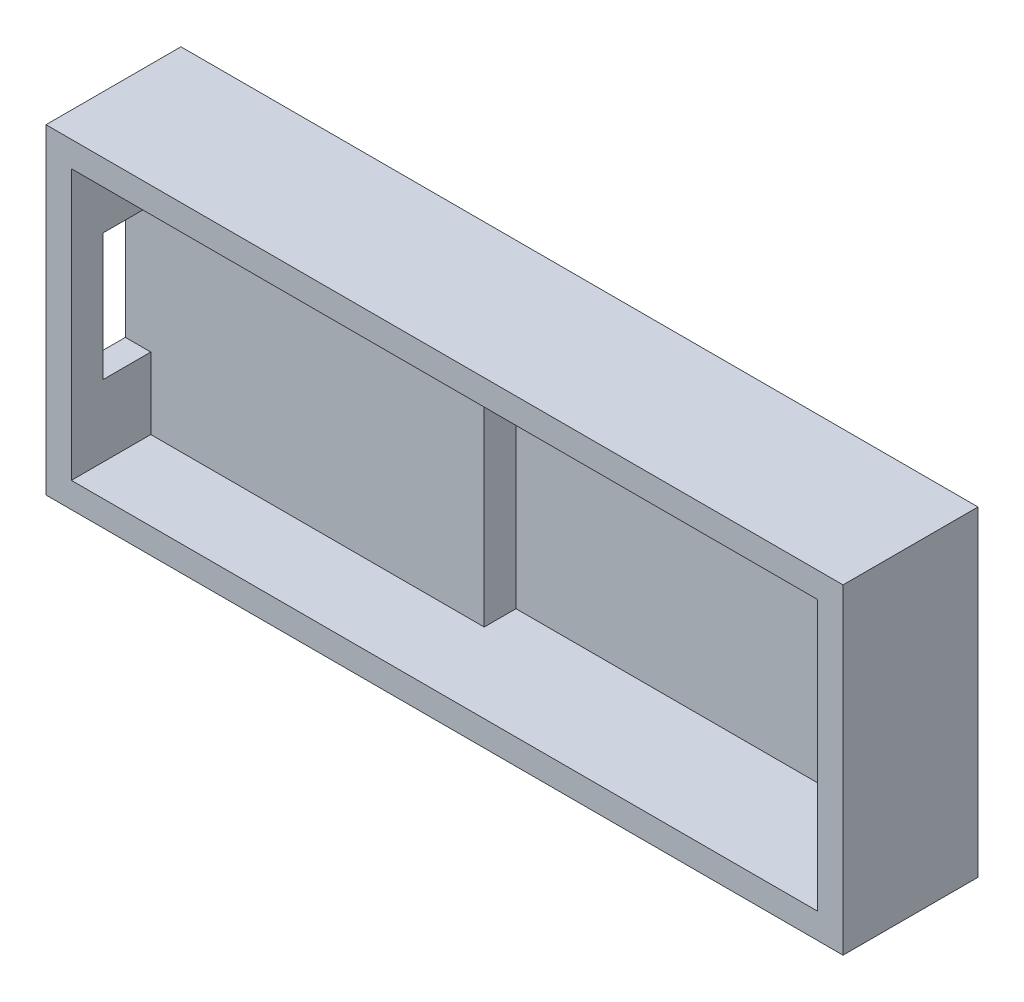
ISO-10303-21;
HEADER;
FILE_DESCRIPTION(('STEP AP214'),'2;1');
FILE_NAME('part.step','',(''),(''),'','','');
FILE_SCHEMA(('AUTOMOTIVE_DESIGN { 1 0 10303 214 1 1 1 1 }'));
ENDSEC;
DATA;
#1=APPLICATION_CONTEXT('core data for automotive mechanical design processes');
#2=APPLICATION_PROTOCOL_DEFINITION('international standard','automotive_design',2000,#1);
#3=PRODUCT_CONTEXT('',#1,'mechanical');
#4=PRODUCT('Part','Part','',(#3));
#5=PRODUCT_RELATED_PRODUCT_CATEGORY('part','',(#4));
#6=PRODUCT_DEFINITION_FORMATION('','',#4);
#7=PRODUCT_DEFINITION_CONTEXT('part definition',#1,'design');
#8=PRODUCT_DEFINITION('design','',#6,#7);
#9=PRODUCT_DEFINITION_SHAPE('','',#8);
#10=(LENGTH_UNIT() NAMED_UNIT(*) SI_UNIT(.MILLI.,.METRE.));
#11=(NAMED_UNIT(*) PLANE_ANGLE_UNIT() SI_UNIT($,.RADIAN.));
#12=(NAMED_UNIT(*) SI_UNIT($,.STERADIAN.) SOLID_ANGLE_UNIT());
#13=UNCERTAINTY_MEASURE_WITH_UNIT(LENGTH_MEASURE(1.E-05),#10,'distance_accuracy_value','');
#14=(GEOMETRIC_REPRESENTATION_CONTEXT(3) GLOBAL_UNCERTAINTY_ASSIGNED_CONTEXT((#13)) GLOBAL_UNIT_ASSIGNED_CONTEXT((#10,
#11,#12)) REPRESENTATION_CONTEXT('',''));
#15=CARTESIAN_POINT('',(0.,0.,0.));
#16=DIRECTION('',(0.,0.,1.));
#17=DIRECTION('',(1.,0.,0.));
#18=AXIS2_PLACEMENT_3D('',#15,#16,#17);
#19=CARTESIAN_POINT('',(0.,0.,1.5));
#20=DIRECTION('',(0.,0.,1.));
#21=DIRECTION('',(1.,0.,0.));
#22=AXIS2_PLACEMENT_3D('',#19,#20,#21);
#23=PLANE('',#22);
#24=DIRECTION('',(0.,-1.,0.));
#25=VECTOR('',#24,1.);
#26=CARTESIAN_POINT('',(19.5,-8.5,1.5));
#27=LINE('',#26,#25);
#28=CARTESIAN_POINT('',(19.5,-6.5,1.5));
#29=VERTEX_POINT('',#28);
#30=CARTESIAN_POINT('',(19.5,-8.5,1.5));
#31=VERTEX_POINT('',#30);
#32=EDGE_CURVE('E266',#29,#31,#27,.T.);
#33=ORIENTED_EDGE('',*,*,#32,.F.);
#34=DIRECTION('',(-1.,0.,0.));
#35=VECTOR('',#34,1.);
#36=CARTESIAN_POINT('',(23.5,-6.5,1.5));
#37=LINE('',#36,#35);
#38=CARTESIAN_POINT('',(23.5,-6.5,1.5));
#39=VERTEX_POINT('',#38);
#40=EDGE_CURVE('E261',#39,#29,#37,.T.);
#41=ORIENTED_EDGE('',*,*,#40,.F.);
#42=DIRECTION('',(0.,1.,0.));
#43=VECTOR('',#42,1.);
#44=CARTESIAN_POINT('',(23.5,8.5,1.5));
#45=LINE('',#44,#43);
#46=CARTESIAN_POINT('',(23.5,6.5,1.5));
#47=VERTEX_POINT('',#46);
#48=EDGE_CURVE('E44',#39,#47,#45,.T.);
#49=ORIENTED_EDGE('',*,*,#48,.T.);
#50=DIRECTION('',(1.,0.,0.));
#51=VECTOR('',#50,1.);
#52=CARTESIAN_POINT('',(23.5,6.5,1.5));
#53=LINE('',#52,#51);
#54=CARTESIAN_POINT('',(19.5,6.5,1.5));
#55=VERTEX_POINT('',#54);
#56=EDGE_CURVE('E291',#55,#47,#53,.T.);
#57=ORIENTED_EDGE('',*,*,#56,.F.);
#58=DIRECTION('',(0.,-1.,0.));
#59=VECTOR('',#58,1.);
#60=CARTESIAN_POINT('',(19.5,8.5,1.5));
#61=LINE('',#60,#59);
#62=CARTESIAN_POINT('',(19.5,8.5,1.5));
#63=VERTEX_POINT('',#62);
#64=EDGE_CURVE('E286',#63,#55,#61,.T.);
#65=ORIENTED_EDGE('',*,*,#64,.F.);
#66=DIRECTION('',(-1.,0.,0.));
#67=VECTOR('',#66,1.);
#68=CARTESIAN_POINT('',(-23.5,8.5,1.5));
#69=LINE('',#68,#67);
#70=CARTESIAN_POINT('',(-2.5,8.5,1.5));
#71=VERTEX_POINT('',#70);
#72=EDGE_CURVE('E12',#63,#71,#69,.T.);
#73=ORIENTED_EDGE('',*,*,#72,.T.);
#74=DIRECTION('',(0.,1.,0.));
#75=VECTOR('',#74,1.);
#76=CARTESIAN_POINT('',(-2.5,8.5,1.5));
#77=LINE('',#76,#75);
#78=CARTESIAN_POINT('',(-2.5,-8.5,1.5));
#79=VERTEX_POINT('',#78);
#80=EDGE_CURVE('E310',#79,#71,#77,.T.);
#81=ORIENTED_EDGE('',*,*,#80,.F.);
#82=DIRECTION('',(1.,0.,0.));
#83=VECTOR('',#82,1.);
#84=CARTESIAN_POINT('',(-23.5,-8.5,1.5));
#85=LINE('',#84,#83);
#86=EDGE_CURVE('E333',#79,#31,#85,.T.);
#87=ORIENTED_EDGE('',*,*,#86,.T.);
#88=EDGE_LOOP('',(#33,#41,#49,#57,#65,#73,#81,#87));
#89=FACE_BOUND('',#88,.T.);
#90=ADVANCED_FACE('F35',(#89),#23,.T.);
#91=CARTESIAN_POINT('',(-2.5,8.5,3.5));
#92=DIRECTION('',(-1.,0.,0.));
#93=DIRECTION('',(0.,-1.,0.));
#94=AXIS2_PLACEMENT_3D('',#91,#92,#93);
#95=PLANE('',#94);
#96=ORIENTED_EDGE('',*,*,#80,.T.);
#97=DIRECTION('',(0.,0.,-1.));
#98=VECTOR('',#97,1.);
#99=CARTESIAN_POINT('',(-2.5,8.5,3.5));
#100=LINE('',#99,#98);
#101=CARTESIAN_POINT('',(-2.5,8.5,3.5));
#102=VERTEX_POINT('',#101);
#103=EDGE_CURVE('E324',#102,#71,#100,.T.);
#104=ORIENTED_EDGE('',*,*,#103,.F.);
#105=DIRECTION('',(0.,1.,0.));
#106=VECTOR('',#105,1.);
#107=CARTESIAN_POINT('',(-2.5,8.5,3.5));
#108=LINE('',#107,#106);
#109=CARTESIAN_POINT('',(-2.5,-8.5,3.5));
#110=VERTEX_POINT('',#109);
#111=EDGE_CURVE('E318',#110,#102,#108,.T.);
#112=ORIENTED_EDGE('',*,*,#111,.F.);
#113=DIRECTION('',(0.,0.,-1.));
#114=VECTOR('',#113,1.);
#115=CARTESIAN_POINT('',(-2.5,-8.5,3.5));
#116=LINE('',#115,#114);
#117=EDGE_CURVE('E335',#110,#79,#116,.T.);
#118=ORIENTED_EDGE('',*,*,#117,.T.);
#119=EDGE_LOOP('',(#96,#104,#112,#118));
#120=FACE_BOUND('',#119,.T.);
#121=ADVANCED_FACE('F361',(#120),#95,.F.);
#122=CARTESIAN_POINT('',(0.,0.,3.5));
#123=DIRECTION('',(0.,0.,1.));
#124=DIRECTION('',(1.,0.,0.));
#125=AXIS2_PLACEMENT_3D('',#122,#123,#124);
#126=PLANE('',#125);
#127=DIRECTION('',(0.,-1.,0.));
#128=VECTOR('',#127,1.);
#129=CARTESIAN_POINT('',(-23.5,8.5,3.5));
#130=LINE('',#129,#128);
#131=CARTESIAN_POINT('',(-23.5,8.5,3.5));
#132=VERTEX_POINT('',#131);
#133=CARTESIAN_POINT('',(-23.5,4.,3.5));
#134=VERTEX_POINT('',#133);
#135=EDGE_CURVE('E311',#132,#134,#130,.T.);
#136=ORIENTED_EDGE('',*,*,#135,.T.);
#137=DIRECTION('',(1.,0.,0.));
#138=VECTOR('',#137,1.);
#139=CARTESIAN_POINT('',(-25.1,4.,3.5));
#140=LINE('',#139,#138);
#141=CARTESIAN_POINT('',(-25.1,4.,3.5));
#142=VERTEX_POINT('',#141);
#143=EDGE_CURVE('E201',#142,#134,#140,.T.);
#144=ORIENTED_EDGE('',*,*,#143,.F.);
#145=DIRECTION('',(0.,1.,0.));
#146=VECTOR('',#145,1.);
#147=CARTESIAN_POINT('',(-25.1,4.,3.5));
#148=LINE('',#147,#146);
#149=CARTESIAN_POINT('',(-25.1,-4.,3.5));
#150=VERTEX_POINT('',#149);
#151=EDGE_CURVE('E181',#150,#142,#148,.T.);
#152=ORIENTED_EDGE('',*,*,#151,.F.);
#153=DIRECTION('',(1.,0.,0.));
#154=VECTOR('',#153,1.);
#155=CARTESIAN_POINT('',(-25.1,-4.,3.5));
#156=LINE('',#155,#154);
#157=CARTESIAN_POINT('',(-23.5,-4.,3.5));
#158=VERTEX_POINT('',#157);
#159=EDGE_CURVE('E204',#150,#158,#156,.T.);
#160=ORIENTED_EDGE('',*,*,#159,.T.);
#161=CARTESIAN_POINT('',(-23.5,-8.5,3.5));
#162=VERTEX_POINT('',#161);
#163=EDGE_CURVE('E315',#158,#162,#130,.T.);
#164=ORIENTED_EDGE('',*,*,#163,.T.);
#165=DIRECTION('',(1.,0.,0.));
#166=VECTOR('',#165,1.);
#167=CARTESIAN_POINT('',(-23.5,-8.5,3.5));
#168=LINE('',#167,#166);
#169=EDGE_CURVE('E314',#162,#110,#168,.T.);
#170=ORIENTED_EDGE('',*,*,#169,.T.);
#171=ORIENTED_EDGE('',*,*,#111,.T.);
#172=DIRECTION('',(-1.,0.,0.));
#173=VECTOR('',#172,1.);
#174=CARTESIAN_POINT('',(-23.5,8.5,3.5));
#175=LINE('',#174,#173);
#176=EDGE_CURVE('E321',#102,#132,#175,.T.);
#177=ORIENTED_EDGE('',*,*,#176,.T.);
#178=EDGE_LOOP('',(#136,#144,#152,#160,#164,#170,#171,#177));
#179=FACE_BOUND('',#178,.T.);
#180=ADVANCED_FACE('F365',(#179),#126,.T.);
#181=CARTESIAN_POINT('',(19.5,8.5,3.5));
#182=DIRECTION('',(1.,0.,0.));
#183=DIRECTION('',(0.,0.,-1.));
#184=AXIS2_PLACEMENT_3D('',#181,#182,#183);
#185=PLANE('',#184);
#186=ORIENTED_EDGE('',*,*,#64,.T.);
#187=DIRECTION('',(0.,0.,-1.));
#188=VECTOR('',#187,1.);
#189=CARTESIAN_POINT('',(19.5,6.5,3.5));
#190=LINE('',#189,#188);
#191=CARTESIAN_POINT('',(19.5,6.5,3.5));
#192=VERTEX_POINT('',#191);
#193=EDGE_CURVE('E305',#192,#55,#190,.T.);
#194=ORIENTED_EDGE('',*,*,#193,.F.);
#195=DIRECTION('',(0.,-1.,0.));
#196=VECTOR('',#195,1.);
#197=CARTESIAN_POINT('',(19.5,8.5,3.5));
#198=LINE('',#197,#196);
#199=CARTESIAN_POINT('',(19.5,8.5,3.5));
#200=VERTEX_POINT('',#199);
#201=EDGE_CURVE('E294',#200,#192,#198,.T.);
#202=ORIENTED_EDGE('',*,*,#201,.F.);
#203=DIRECTION('',(0.,0.,-1.));
#204=VECTOR('',#203,1.);
#205=CARTESIAN_POINT('',(19.5,8.5,3.5));
#206=LINE('',#205,#204);
#207=EDGE_CURVE('E307',#200,#63,#206,.T.);
#208=ORIENTED_EDGE('',*,*,#207,.T.);
#209=EDGE_LOOP('',(#186,#194,#202,#208));
#210=FACE_BOUND('',#209,.T.);
#211=ADVANCED_FACE('F358',(#210),#185,.F.);
#212=CARTESIAN_POINT('',(23.5,6.5,3.5));
#213=DIRECTION('',(0.,1.,0.));
#214=DIRECTION('',(-1.,0.,0.));
#215=AXIS2_PLACEMENT_3D('',#212,#213,#214);
#216=PLANE('',#215);
#217=ORIENTED_EDGE('',*,*,#56,.T.);
#218=DIRECTION('',(0.,0.,-1.));
#219=VECTOR('',#218,1.);
#220=CARTESIAN_POINT('',(23.5,6.5,3.5));
#221=LINE('',#220,#219);
#222=CARTESIAN_POINT('',(23.5,6.5,3.5));
#223=VERTEX_POINT('',#222);
#224=EDGE_CURVE('E299',#223,#47,#221,.T.);
#225=ORIENTED_EDGE('',*,*,#224,.F.);
#226=DIRECTION('',(1.,0.,0.));
#227=VECTOR('',#226,1.);
#228=CARTESIAN_POINT('',(23.5,6.5,3.5));
#229=LINE('',#228,#227);
#230=EDGE_CURVE('E296',#192,#223,#229,.T.);
#231=ORIENTED_EDGE('',*,*,#230,.F.);
#232=ORIENTED_EDGE('',*,*,#193,.T.);
#233=EDGE_LOOP('',(#217,#225,#231,#232));
#234=FACE_BOUND('',#233,.T.);
#235=ADVANCED_FACE('F353',(#234),#216,.F.);
#236=CARTESIAN_POINT('',(0.,0.,3.5));
#237=DIRECTION('',(0.,0.,-1.));
#238=DIRECTION('',(-1.,0.,0.));
#239=AXIS2_PLACEMENT_3D('',#236,#237,#238);
#240=PLANE('',#239);
#241=DIRECTION('',(0.,1.,0.));
#242=VECTOR('',#241,1.);
#243=CARTESIAN_POINT('',(23.5,8.5,3.5));
#244=LINE('',#243,#242);
#245=CARTESIAN_POINT('',(23.5,8.5,3.5));
#246=VERTEX_POINT('',#245);
#247=EDGE_CURVE('E287',#223,#246,#244,.T.);
#248=ORIENTED_EDGE('',*,*,#247,.T.);
#249=DIRECTION('',(-1.,0.,0.));
#250=VECTOR('',#249,1.);
#251=CARTESIAN_POINT('',(23.5,8.5,3.5));
#252=LINE('',#251,#250);
#253=EDGE_CURVE('E290',#246,#200,#252,.T.);
#254=ORIENTED_EDGE('',*,*,#253,.T.);
#255=ORIENTED_EDGE('',*,*,#201,.T.);
#256=ORIENTED_EDGE('',*,*,#230,.T.);
#257=EDGE_LOOP('',(#248,#254,#255,#256));
#258=FACE_BOUND('',#257,.T.);
#259=ADVANCED_FACE('F391',(#258),#240,.F.);
#260=CARTESIAN_POINT('',(23.5,-6.5,3.5));
#261=DIRECTION('',(0.,-1.,0.));
#262=DIRECTION('',(1.,0.,0.));
#263=AXIS2_PLACEMENT_3D('',#260,#261,#262);
#264=PLANE('',#263);
#265=ORIENTED_EDGE('',*,*,#40,.T.);
#266=DIRECTION('',(0.,0.,-1.));
#267=VECTOR('',#266,1.);
#268=CARTESIAN_POINT('',(19.5,-6.5,3.5));
#269=LINE('',#268,#267);
#270=CARTESIAN_POINT('',(19.5,-6.5,3.5));
#271=VERTEX_POINT('',#270);
#272=EDGE_CURVE('E280',#271,#29,#269,.T.);
#273=ORIENTED_EDGE('',*,*,#272,.F.);
#274=DIRECTION('',(-1.,0.,0.));
#275=VECTOR('',#274,1.);
#276=CARTESIAN_POINT('',(23.5,-6.5,3.5));
#277=LINE('',#276,#275);
#278=CARTESIAN_POINT('',(23.5,-6.5,3.5));
#279=VERTEX_POINT('',#278);
#280=EDGE_CURVE('E265',#279,#271,#277,.T.);
#281=ORIENTED_EDGE('',*,*,#280,.F.);
#282=DIRECTION('',(0.,0.,-1.));
#283=VECTOR('',#282,1.);
#284=CARTESIAN_POINT('',(23.5,-6.5,3.5));
#285=LINE('',#284,#283);
#286=EDGE_CURVE('E283',#279,#39,#285,.T.);
#287=ORIENTED_EDGE('',*,*,#286,.T.);
#288=EDGE_LOOP('',(#265,#273,#281,#287));
#289=FACE_BOUND('',#288,.T.);
#290=ADVANCED_FACE('F389',(#289),#264,.F.);
#291=CARTESIAN_POINT('',(19.5,-8.5,3.5));
#292=DIRECTION('',(1.,0.,0.));
#293=DIRECTION('',(0.,0.,-1.));
#294=AXIS2_PLACEMENT_3D('',#291,#292,#293);
#295=PLANE('',#294);
#296=ORIENTED_EDGE('',*,*,#32,.T.);
#297=DIRECTION('',(0.,0.,-1.));
#298=VECTOR('',#297,1.);
#299=CARTESIAN_POINT('',(19.5,-8.5,3.5));
#300=LINE('',#299,#298);
#301=CARTESIAN_POINT('',(19.5,-8.5,3.5));
#302=VERTEX_POINT('',#301);
#303=EDGE_CURVE('E274',#302,#31,#300,.T.);
#304=ORIENTED_EDGE('',*,*,#303,.F.);
#305=DIRECTION('',(0.,-1.,0.));
#306=VECTOR('',#305,1.);
#307=CARTESIAN_POINT('',(19.5,-8.5,3.5));
#308=LINE('',#307,#306);
#309=EDGE_CURVE('E268',#271,#302,#308,.T.);
#310=ORIENTED_EDGE('',*,*,#309,.F.);
#311=ORIENTED_EDGE('',*,*,#272,.T.);
#312=EDGE_LOOP('',(#296,#304,#310,#311));
#313=FACE_BOUND('',#312,.T.);
#314=ADVANCED_FACE('F387',(#313),#295,.F.);
#315=CARTESIAN_POINT('',(0.,0.,3.5));
#316=DIRECTION('',(0.,0.,1.));
#317=DIRECTION('',(1.,0.,0.));
#318=AXIS2_PLACEMENT_3D('',#315,#316,#317);
#319=PLANE('',#318);
#320=DIRECTION('',(0.,1.,0.));
#321=VECTOR('',#320,1.);
#322=CARTESIAN_POINT('',(23.5,-8.5,3.5));
#323=LINE('',#322,#321);
#324=CARTESIAN_POINT('',(23.5,-8.5,3.5));
#325=VERTEX_POINT('',#324);
#326=EDGE_CURVE('E262',#325,#279,#323,.T.);
#327=ORIENTED_EDGE('',*,*,#326,.T.);
#328=ORIENTED_EDGE('',*,*,#280,.T.);
#329=ORIENTED_EDGE('',*,*,#309,.T.);
#330=DIRECTION('',(1.,0.,0.));
#331=VECTOR('',#330,1.);
#332=CARTESIAN_POINT('',(23.5,-8.5,3.5));
#333=LINE('',#332,#331);
#334=EDGE_CURVE('E271',#302,#325,#333,.T.);
#335=ORIENTED_EDGE('',*,*,#334,.T.);
#336=EDGE_LOOP('',(#327,#328,#329,#335));
#337=FACE_BOUND('',#336,.T.);
#338=ADVANCED_FACE('F382',(#337),#319,.T.);
#339=CARTESIAN_POINT('',(23.5,8.5,69.6117362500965));
#340=DIRECTION('',(-1.,0.,0.));
#341=DIRECTION('',(0.,0.,1.));
#342=AXIS2_PLACEMENT_3D('',#339,#340,#341);
#343=PLANE('',#342);
#344=ORIENTED_EDGE('',*,*,#247,.F.);
#345=ORIENTED_EDGE('',*,*,#224,.T.);
#346=ORIENTED_EDGE('',*,*,#48,.F.);
#347=ORIENTED_EDGE('',*,*,#286,.F.);
#348=ORIENTED_EDGE('',*,*,#326,.F.);
#349=DIRECTION('',(0.,0.,-1.));
#350=VECTOR('',#349,1.);
#351=CARTESIAN_POINT('',(23.5,-8.5,69.6117362500965));
#352=LINE('',#351,#350);
#353=CARTESIAN_POINT('',(23.5,-8.5,8.5));
#354=VERTEX_POINT('',#353);
#355=EDGE_CURVE('E233',#354,#325,#352,.T.);
#356=ORIENTED_EDGE('',*,*,#355,.F.);
#357=DIRECTION('',(0.,1.,0.));
#358=VECTOR('',#357,1.);
#359=CARTESIAN_POINT('',(23.5,8.5,8.5));
#360=LINE('',#359,#358);
#361=CARTESIAN_POINT('',(23.5,8.5,8.5));
#362=VERTEX_POINT('',#361);
#363=EDGE_CURVE('E203',#354,#362,#360,.T.);
#364=ORIENTED_EDGE('',*,*,#363,.T.);
#365=DIRECTION('',(0.,0.,-1.));
#366=VECTOR('',#365,1.);
#367=CARTESIAN_POINT('',(23.5,8.5,69.6117362500965));
#368=LINE('',#367,#366);
#369=EDGE_CURVE('E230',#362,#246,#368,.T.);
#370=ORIENTED_EDGE('',*,*,#369,.T.);
#371=EDGE_LOOP('',(#344,#345,#346,#347,#348,#356,#364,#370));
#372=FACE_BOUND('',#371,.T.);
#373=ADVANCED_FACE('F379',(#372),#343,.T.);
#374=CARTESIAN_POINT('',(-25.1,10.1,69.6117362500965));
#375=DIRECTION('',(0.,-1.,0.));
#376=DIRECTION('',(0.,0.,-1.));
#377=AXIS2_PLACEMENT_3D('',#374,#375,#376);
#378=PLANE('',#377);
#379=DIRECTION('',(-1.,0.,0.));
#380=VECTOR('',#379,1.);
#381=CARTESIAN_POINT('',(-25.1,10.1,8.5));
#382=LINE('',#381,#380);
#383=CARTESIAN_POINT('',(25.1,10.1,8.5));
#384=VERTEX_POINT('',#383);
#385=CARTESIAN_POINT('',(-25.1,10.1,8.5));
#386=VERTEX_POINT('',#385);
#387=EDGE_CURVE('E215',#384,#386,#382,.T.);
#388=ORIENTED_EDGE('',*,*,#387,.F.);
#389=DIRECTION('',(0.,0.,-1.));
#390=VECTOR('',#389,1.);
#391=CARTESIAN_POINT('',(25.1,10.1,69.6117362500965));
#392=LINE('',#391,#390);
#393=CARTESIAN_POINT('',(25.1,10.1,0.));
#394=VERTEX_POINT('',#393);
#395=EDGE_CURVE('E252',#384,#394,#392,.T.);
#396=ORIENTED_EDGE('',*,*,#395,.T.);
#397=DIRECTION('',(-1.,0.,0.));
#398=VECTOR('',#397,1.);
#399=CARTESIAN_POINT('',(-25.1,10.1,0.));
#400=LINE('',#399,#398);
#401=CARTESIAN_POINT('',(-25.1,10.1,0.));
#402=VERTEX_POINT('',#401);
#403=EDGE_CURVE('E247',#394,#402,#400,.T.);
#404=ORIENTED_EDGE('',*,*,#403,.T.);
#405=DIRECTION('',(0.,0.,-1.));
#406=VECTOR('',#405,1.);
#407=CARTESIAN_POINT('',(-25.1,10.1,69.6117362500965));
#408=LINE('',#407,#406);
#409=EDGE_CURVE('E250',#386,#402,#408,.T.);
#410=ORIENTED_EDGE('',*,*,#409,.F.);
#411=EDGE_LOOP('',(#388,#396,#404,#410));
#412=FACE_BOUND('',#411,.T.);
#413=ADVANCED_FACE('F446',(#412),#378,.F.);
#414=CARTESIAN_POINT('',(25.1,10.1,69.6117362500965));
#415=DIRECTION('',(-1.,0.,0.));
#416=DIRECTION('',(0.,0.,1.));
#417=AXIS2_PLACEMENT_3D('',#414,#415,#416);
#418=PLANE('',#417);
#419=DIRECTION('',(0.,1.,0.));
#420=VECTOR('',#419,1.);
#421=CARTESIAN_POINT('',(25.1,10.1,8.5));
#422=LINE('',#421,#420);
#423=CARTESIAN_POINT('',(25.1,-10.1,8.5));
#424=VERTEX_POINT('',#423);
#425=EDGE_CURVE('E218',#424,#384,#422,.T.);
#426=ORIENTED_EDGE('',*,*,#425,.F.);
#427=DIRECTION('',(0.,0.,-1.));
#428=VECTOR('',#427,1.);
#429=CARTESIAN_POINT('',(25.1,-10.1,69.6117362500965));
#430=LINE('',#429,#428);
#431=CARTESIAN_POINT('',(25.1,-10.1,0.));
#432=VERTEX_POINT('',#431);
#433=EDGE_CURVE('E254',#424,#432,#430,.T.);
#434=ORIENTED_EDGE('',*,*,#433,.T.);
#435=DIRECTION('',(0.,1.,0.));
#436=VECTOR('',#435,1.);
#437=CARTESIAN_POINT('',(25.1,10.1,0.));
#438=LINE('',#437,#436);
#439=EDGE_CURVE('E244',#432,#394,#438,.T.);
#440=ORIENTED_EDGE('',*,*,#439,.T.);
#441=ORIENTED_EDGE('',*,*,#395,.F.);
#442=EDGE_LOOP('',(#426,#434,#440,#441));
#443=FACE_BOUND('',#442,.T.);
#444=ADVANCED_FACE('F455',(#443),#418,.F.);
#445=CARTESIAN_POINT('',(-25.1,-10.1,69.6117362500965));
#446=DIRECTION('',(0.,1.,0.));
#447=DIRECTION('',(0.,0.,1.));
#448=AXIS2_PLACEMENT_3D('',#445,#446,#447);
#449=PLANE('',#448);
#450=DIRECTION('',(1.,0.,0.));
#451=VECTOR('',#450,1.);
#452=CARTESIAN_POINT('',(-25.1,-10.1,8.5));
#453=LINE('',#452,#451);
#454=CARTESIAN_POINT('',(-25.1,-10.1,8.5));
#455=VERTEX_POINT('',#454);
#456=EDGE_CURVE('E221',#455,#424,#453,.T.);
#457=ORIENTED_EDGE('',*,*,#456,.F.);
#458=DIRECTION('',(0.,0.,-1.));
#459=VECTOR('',#458,1.);
#460=CARTESIAN_POINT('',(-25.1,-10.1,69.6117362500965));
#461=LINE('',#460,#459);
#462=CARTESIAN_POINT('',(-25.1,-10.1,0.));
#463=VERTEX_POINT('',#462);
#464=EDGE_CURVE('E256',#455,#463,#461,.T.);
#465=ORIENTED_EDGE('',*,*,#464,.T.);
#466=DIRECTION('',(1.,0.,0.));
#467=VECTOR('',#466,1.);
#468=CARTESIAN_POINT('',(-25.1,-10.1,0.));
#469=LINE('',#468,#467);
#470=EDGE_CURVE('E241',#463,#432,#469,.T.);
#471=ORIENTED_EDGE('',*,*,#470,.T.);
#472=ORIENTED_EDGE('',*,*,#433,.F.);
#473=EDGE_LOOP('',(#457,#465,#471,#472));
#474=FACE_BOUND('',#473,.T.);
#475=ADVANCED_FACE('F465',(#474),#449,.F.);
#476=CARTESIAN_POINT('',(-25.1,10.1,69.6117362500965));
#477=DIRECTION('',(1.,0.,0.));
#478=DIRECTION('',(0.,0.,-1.));
#479=AXIS2_PLACEMENT_3D('',#476,#477,#478);
#480=PLANE('',#479);
#481=ORIENTED_EDGE('',*,*,#151,.T.);
#482=DIRECTION('',(0.,0.,1.));
#483=VECTOR('',#482,1.);
#484=CARTESIAN_POINT('',(-25.1,4.,3.5));
#485=LINE('',#484,#483);
#486=CARTESIAN_POINT('',(-25.1,4.,6.50000000000001));
#487=VERTEX_POINT('',#486);
#488=EDGE_CURVE('E175',#142,#487,#485,.T.);
#489=ORIENTED_EDGE('',*,*,#488,.T.);
#490=DIRECTION('',(0.,-1.,0.));
#491=VECTOR('',#490,1.);
#492=CARTESIAN_POINT('',(-25.1,4.,6.50000000000001));
#493=LINE('',#492,#491);
#494=CARTESIAN_POINT('',(-25.1,-4.,6.5));
#495=VERTEX_POINT('',#494);
#496=EDGE_CURVE('E184',#487,#495,#493,.T.);
#497=ORIENTED_EDGE('',*,*,#496,.T.);
#498=DIRECTION('',(0.,0.,-1.));
#499=VECTOR('',#498,1.);
#500=CARTESIAN_POINT('',(-25.1,-4.,3.5));
#501=LINE('',#500,#499);
#502=EDGE_CURVE('E51',#495,#150,#501,.T.);
#503=ORIENTED_EDGE('',*,*,#502,.T.);
#504=EDGE_LOOP('',(#481,#489,#497,#503));
#505=FACE_BOUND('',#504,.T.);
#506=DIRECTION('',(0.,-1.,0.));
#507=VECTOR('',#506,1.);
#508=CARTESIAN_POINT('',(-25.1,10.1,8.5));
#509=LINE('',#508,#507);
#510=EDGE_CURVE('E224',#386,#455,#509,.T.);
#511=ORIENTED_EDGE('',*,*,#510,.F.);
#512=ORIENTED_EDGE('',*,*,#409,.T.);
#513=DIRECTION('',(0.,-1.,0.));
#514=VECTOR('',#513,1.);
#515=CARTESIAN_POINT('',(-25.1,10.1,0.));
#516=LINE('',#515,#514);
#517=EDGE_CURVE('E238',#402,#463,#516,.T.);
#518=ORIENTED_EDGE('',*,*,#517,.T.);
#519=ORIENTED_EDGE('',*,*,#464,.F.);
#520=EDGE_LOOP('',(#511,#512,#518,#519));
#521=FACE_BOUND('',#520,.T.);
#522=ADVANCED_FACE('F188',(#505,#521),#480,.F.);
#523=CARTESIAN_POINT('',(-23.5,8.5,69.6117362500965));
#524=DIRECTION('',(0.,-1.,0.));
#525=DIRECTION('',(0.,0.,-1.));
#526=AXIS2_PLACEMENT_3D('',#523,#524,#525);
#527=PLANE('',#526);
#528=DIRECTION('',(0.,0.,-1.));
#529=VECTOR('',#528,1.);
#530=CARTESIAN_POINT('',(-23.5,8.5,69.6117362500965));
#531=LINE('',#530,#529);
#532=CARTESIAN_POINT('',(-23.5,8.5,8.5));
#533=VERTEX_POINT('',#532);
#534=EDGE_CURVE('E227',#533,#132,#531,.T.);
#535=ORIENTED_EDGE('',*,*,#534,.T.);
#536=ORIENTED_EDGE('',*,*,#176,.F.);
#537=ORIENTED_EDGE('',*,*,#103,.T.);
#538=ORIENTED_EDGE('',*,*,#72,.F.);
#539=ORIENTED_EDGE('',*,*,#207,.F.);
#540=ORIENTED_EDGE('',*,*,#253,.F.);
#541=ORIENTED_EDGE('',*,*,#369,.F.);
#542=DIRECTION('',(-1.,0.,0.));
#543=VECTOR('',#542,1.);
#544=CARTESIAN_POINT('',(-23.5,8.5,8.5));
#545=LINE('',#544,#543);
#546=EDGE_CURVE('E258',#362,#533,#545,.T.);
#547=ORIENTED_EDGE('',*,*,#546,.T.);
#548=EDGE_LOOP('',(#535,#536,#537,#538,#539,#540,#541,#547));
#549=FACE_BOUND('',#548,.T.);
#550=ADVANCED_FACE('F362',(#549),#527,.T.);
#551=CARTESIAN_POINT('',(-23.5,-8.5,69.6117362500965));
#552=DIRECTION('',(0.,1.,0.));
#553=DIRECTION('',(0.,0.,1.));
#554=AXIS2_PLACEMENT_3D('',#551,#552,#553);
#555=PLANE('',#554);
#556=ORIENTED_EDGE('',*,*,#117,.F.);
#557=ORIENTED_EDGE('',*,*,#169,.F.);
#558=DIRECTION('',(0.,0.,-1.));
#559=VECTOR('',#558,1.);
#560=CARTESIAN_POINT('',(-23.5,-8.5,69.6117362500965));
#561=LINE('',#560,#559);
#562=CARTESIAN_POINT('',(-23.5,-8.5,8.5));
#563=VERTEX_POINT('',#562);
#564=EDGE_CURVE('E235',#563,#162,#561,.T.);
#565=ORIENTED_EDGE('',*,*,#564,.F.);
#566=DIRECTION('',(1.,0.,0.));
#567=VECTOR('',#566,1.);
#568=CARTESIAN_POINT('',(-23.5,-8.5,8.5));
#569=LINE('',#568,#567);
#570=EDGE_CURVE('E209',#563,#354,#569,.T.);
#571=ORIENTED_EDGE('',*,*,#570,.T.);
#572=ORIENTED_EDGE('',*,*,#355,.T.);
#573=ORIENTED_EDGE('',*,*,#334,.F.);
#574=ORIENTED_EDGE('',*,*,#303,.T.);
#575=ORIENTED_EDGE('',*,*,#86,.F.);
#576=EDGE_LOOP('',(#556,#557,#565,#571,#572,#573,#574,#575));
#577=FACE_BOUND('',#576,.T.);
#578=ADVANCED_FACE('F370',(#577),#555,.T.);
#579=CARTESIAN_POINT('',(-23.5,8.5,69.6117362500965));
#580=DIRECTION('',(1.,0.,0.));
#581=DIRECTION('',(0.,0.,-1.));
#582=AXIS2_PLACEMENT_3D('',#579,#580,#581);
#583=PLANE('',#582);
#584=DIRECTION('',(0.,0.,1.));
#585=VECTOR('',#584,1.);
#586=CARTESIAN_POINT('',(-23.5,4.,3.5));
#587=LINE('',#586,#585);
#588=CARTESIAN_POINT('',(-23.5,4.,6.50000000000001));
#589=VERTEX_POINT('',#588);
#590=EDGE_CURVE('E59',#134,#589,#587,.T.);
#591=ORIENTED_EDGE('',*,*,#590,.F.);
#592=ORIENTED_EDGE('',*,*,#135,.F.);
#593=ORIENTED_EDGE('',*,*,#534,.F.);
#594=DIRECTION('',(0.,-1.,0.));
#595=VECTOR('',#594,1.);
#596=CARTESIAN_POINT('',(-23.5,8.5,8.5));
#597=LINE('',#596,#595);
#598=EDGE_CURVE('E212',#533,#563,#597,.T.);
#599=ORIENTED_EDGE('',*,*,#598,.T.);
#600=ORIENTED_EDGE('',*,*,#564,.T.);
#601=ORIENTED_EDGE('',*,*,#163,.F.);
#602=DIRECTION('',(0.,0.,-1.));
#603=VECTOR('',#602,1.);
#604=CARTESIAN_POINT('',(-23.5,-4.,3.5));
#605=LINE('',#604,#603);
#606=CARTESIAN_POINT('',(-23.5,-4.,6.50000000000001));
#607=VERTEX_POINT('',#606);
#608=EDGE_CURVE('E191',#607,#158,#605,.T.);
#609=ORIENTED_EDGE('',*,*,#608,.F.);
#610=DIRECTION('',(0.,-1.,0.));
#611=VECTOR('',#610,1.);
#612=CARTESIAN_POINT('',(-23.5,4.,6.50000000000001));
#613=LINE('',#612,#611);
#614=EDGE_CURVE('E194',#589,#607,#613,.T.);
#615=ORIENTED_EDGE('',*,*,#614,.F.);
#616=EDGE_LOOP('',(#591,#592,#593,#599,#600,#601,#609,#615));
#617=FACE_BOUND('',#616,.T.);
#618=ADVANCED_FACE('F372',(#617),#583,.T.);
#619=CARTESIAN_POINT('',(0.,0.,8.5));
#620=DIRECTION('',(0.,0.,1.));
#621=DIRECTION('',(1.,0.,0.));
#622=AXIS2_PLACEMENT_3D('',#619,#620,#621);
#623=PLANE('',#622);
#624=ORIENTED_EDGE('',*,*,#598,.F.);
#625=ORIENTED_EDGE('',*,*,#546,.F.);
#626=ORIENTED_EDGE('',*,*,#363,.F.);
#627=ORIENTED_EDGE('',*,*,#570,.F.);
#628=EDGE_LOOP('',(#624,#625,#626,#627));
#629=FACE_BOUND('',#628,.T.);
#630=ORIENTED_EDGE('',*,*,#387,.T.);
#631=ORIENTED_EDGE('',*,*,#510,.T.);
#632=ORIENTED_EDGE('',*,*,#456,.T.);
#633=ORIENTED_EDGE('',*,*,#425,.T.);
#634=EDGE_LOOP('',(#630,#631,#632,#633));
#635=FACE_BOUND('',#634,.T.);
#636=ADVANCED_FACE('F375',(#629,#635),#623,.T.);
#637=CARTESIAN_POINT('',(0.,0.,0.));
#638=DIRECTION('',(0.,0.,1.));
#639=DIRECTION('',(1.,0.,0.));
#640=AXIS2_PLACEMENT_3D('',#637,#638,#639);
#641=PLANE('',#640);
#642=ORIENTED_EDGE('',*,*,#517,.F.);
#643=ORIENTED_EDGE('',*,*,#403,.F.);
#644=ORIENTED_EDGE('',*,*,#439,.F.);
#645=ORIENTED_EDGE('',*,*,#470,.F.);
#646=EDGE_LOOP('',(#642,#643,#644,#645));
#647=FACE_BOUND('',#646,.T.);
#648=ADVANCED_FACE('F37',(#647),#641,.F.);
#649=CARTESIAN_POINT('',(-25.1,4.,3.5));
#650=DIRECTION('',(0.,1.,0.));
#651=DIRECTION('',(0.,0.,1.));
#652=AXIS2_PLACEMENT_3D('',#649,#650,#651);
#653=PLANE('',#652);
#654=ORIENTED_EDGE('',*,*,#590,.T.);
#655=DIRECTION('',(1.,0.,0.));
#656=VECTOR('',#655,1.);
#657=CARTESIAN_POINT('',(-25.1,4.,6.50000000000001));
#658=LINE('',#657,#656);
#659=EDGE_CURVE('E171',#487,#589,#658,.T.);
#660=ORIENTED_EDGE('',*,*,#659,.F.);
#661=ORIENTED_EDGE('',*,*,#488,.F.);
#662=ORIENTED_EDGE('',*,*,#143,.T.);
#663=EDGE_LOOP('',(#654,#660,#661,#662));
#664=FACE_BOUND('',#663,.T.);
#665=ADVANCED_FACE('F173',(#664),#653,.F.);
#666=CARTESIAN_POINT('',(-25.1,-4.,3.5));
#667=DIRECTION('',(0.,-1.,0.));
#668=DIRECTION('',(0.,0.,-1.));
#669=AXIS2_PLACEMENT_3D('',#666,#667,#668);
#670=PLANE('',#669);
#671=ORIENTED_EDGE('',*,*,#608,.T.);
#672=ORIENTED_EDGE('',*,*,#159,.F.);
#673=ORIENTED_EDGE('',*,*,#502,.F.);
#674=DIRECTION('',(1.,0.,0.));
#675=VECTOR('',#674,1.);
#676=CARTESIAN_POINT('',(-25.1,-4.,6.50000000000001));
#677=LINE('',#676,#675);
#678=EDGE_CURVE('E180',#495,#607,#677,.T.);
#679=ORIENTED_EDGE('',*,*,#678,.T.);
#680=EDGE_LOOP('',(#671,#672,#673,#679));
#681=FACE_BOUND('',#680,.T.);
#682=ADVANCED_FACE('F540',(#681),#670,.F.);
#683=CARTESIAN_POINT('',(-25.1,4.,6.50000000000001));
#684=DIRECTION('',(0.,0.,1.));
#685=DIRECTION('',(0.,-1.,0.));
#686=AXIS2_PLACEMENT_3D('',#683,#684,#685);
#687=PLANE('',#686);
#688=ORIENTED_EDGE('',*,*,#614,.T.);
#689=ORIENTED_EDGE('',*,*,#678,.F.);
#690=ORIENTED_EDGE('',*,*,#496,.F.);
#691=ORIENTED_EDGE('',*,*,#659,.T.);
#692=EDGE_LOOP('',(#688,#689,#690,#691));
#693=FACE_BOUND('',#692,.T.);
#694=ADVANCED_FACE('F185',(#693),#687,.F.);
#695=CLOSED_SHELL('',(#90,#121,#180,#211,#235,#259,#290,#314,#338,#373,#413,#444,#475,#522,#550,
#578,#618,#636,#648,#665,#682,#694));
#696=MANIFOLD_SOLID_BREP('B2',#695);
#697=ADVANCED_BREP_SHAPE_REPRESENTATION('',(#18,#696),#14);
#698=SHAPE_DEFINITION_REPRESENTATION(#9,#697);
ENDSEC;
END-ISO-10303-21;
